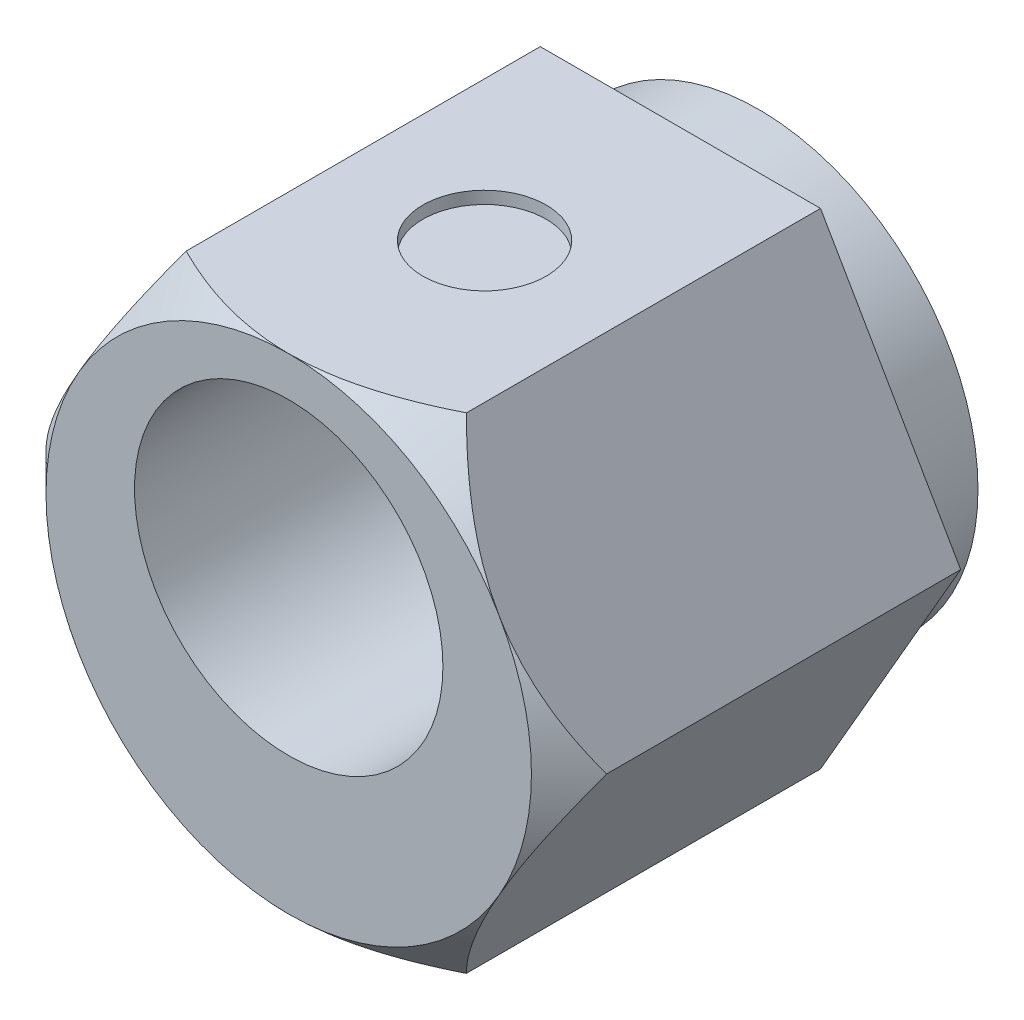
ISO-10303-21;
HEADER;
FILE_DESCRIPTION(('STEP AP214'),'2;1');
FILE_NAME('part.step','',(''),(''),'','','');
FILE_SCHEMA(('AUTOMOTIVE_DESIGN { 1 0 10303 214 1 1 1 1 }'));
ENDSEC;
DATA;
#1=APPLICATION_CONTEXT('core data for automotive mechanical design processes');
#2=APPLICATION_PROTOCOL_DEFINITION('international standard','automotive_design',2000,#1);
#3=PRODUCT_CONTEXT('',#1,'mechanical');
#4=PRODUCT('Part','Part','',(#3));
#5=PRODUCT_RELATED_PRODUCT_CATEGORY('part','',(#4));
#6=PRODUCT_DEFINITION_FORMATION('','',#4);
#7=PRODUCT_DEFINITION_CONTEXT('part definition',#1,'design');
#8=PRODUCT_DEFINITION('design','',#6,#7);
#9=PRODUCT_DEFINITION_SHAPE('','',#8);
#10=(LENGTH_UNIT() NAMED_UNIT(*) SI_UNIT(.MILLI.,.METRE.));
#11=(NAMED_UNIT(*) PLANE_ANGLE_UNIT() SI_UNIT($,.RADIAN.));
#12=(NAMED_UNIT(*) SI_UNIT($,.STERADIAN.) SOLID_ANGLE_UNIT());
#13=UNCERTAINTY_MEASURE_WITH_UNIT(LENGTH_MEASURE(1.E-05),#10,'distance_accuracy_value','');
#14=(GEOMETRIC_REPRESENTATION_CONTEXT(3) GLOBAL_UNCERTAINTY_ASSIGNED_CONTEXT((#13)) GLOBAL_UNIT_ASSIGNED_CONTEXT((#10,
#11,#12)) REPRESENTATION_CONTEXT('',''));
#15=CARTESIAN_POINT('',(0.,0.,0.));
#16=DIRECTION('',(0.,0.,1.));
#17=DIRECTION('',(1.,0.,0.));
#18=AXIS2_PLACEMENT_3D('',#15,#16,#17);
#19=CARTESIAN_POINT('',(2.27187330926118,-3.935,6.35));
#20=DIRECTION('',(-0.866025403784439,0.5,0.));
#21=DIRECTION('',(-0.5,-0.866025403784439,0.));
#22=AXIS2_PLACEMENT_3D('',#19,#20,#21);
#23=PLANE('',#22);
#24=CARTESIAN_POINT('',(2.27175783920734,-3.9352,5.74113790702225));
#25=CARTESIAN_POINT('',(2.31082331662368,-3.86753660829296,5.78019939782444));
#26=CARTESIAN_POINT('',(2.35018773661435,-3.79935543285864,5.81806250313159));
#27=CARTESIAN_POINT('',(2.42957604163856,-3.66185085502993,5.8910266504742));
#28=CARTESIAN_POINT('',(2.46960027263841,-3.59252685340433,5.92612618389363));
#29=CARTESIAN_POINT('',(2.59112694872726,-3.38203647594347,6.02703083232341));
#30=CARTESIAN_POINT('',(2.67366225000178,-3.23908114071799,6.08801147413054));
#31=CARTESIAN_POINT('',(2.84006902700017,-2.950856148233,6.19244398855424));
#32=CARTESIAN_POINT('',(2.9238984692984,-2.8056592950023,6.23615884690859));
#33=CARTESIAN_POINT('',(3.09340844196596,-2.51205940995248,6.30351651032578));
#34=CARTESIAN_POINT('',(3.17908378087713,-2.36366537000264,6.32720957015581));
#35=CARTESIAN_POINT('',(3.3267417531764,-2.10791425983772,6.34858629027159));
#36=CARTESIAN_POINT('',(3.38853414373876,-2.00088669986256,6.35175001817081));
#37=CARTESIAN_POINT('',(3.51201863282563,-1.78700529081743,6.3464170080399));
#38=CARTESIAN_POINT('',(3.57371068860348,-1.68015151578681,6.33791618237832));
#39=CARTESIAN_POINT('',(3.6965102561679,-1.46745642561775,6.30973894507781));
#40=CARTESIAN_POINT('',(3.75761703631313,-1.36161637771927,6.29005003415299));
#41=CARTESIAN_POINT('',(3.87878112158132,-1.15175402598215,6.24057140696216));
#42=CARTESIAN_POINT('',(3.93883850679851,-1.04773158341625,6.21078246514532));
#43=CARTESIAN_POINT('',(4.04545500054664,-0.86306639931963,6.14949467580114));
#44=CARTESIAN_POINT('',(4.09225015435056,-0.782014815383253,6.11960721855959));
#45=CARTESIAN_POINT('',(4.1850004009052,-0.621366675936064,6.05501569852719));
#46=CARTESIAN_POINT('',(4.23095546804853,-0.541770164778593,6.02031148918887));
#47=CARTESIAN_POINT('',(4.32188075595423,-0.384282946433077,5.94686444951026));
#48=CARTESIAN_POINT('',(4.36685356279846,-0.306387760019898,5.90813431896725));
#49=CARTESIAN_POINT('',(4.45596632914802,-0.152039921099436,5.82714402443281));
#50=CARTESIAN_POINT('',(4.50010677953052,-0.0755864183679793,5.78488602621755));
#51=CARTESIAN_POINT('',(4.54386208857619,0.000200000000002672,5.74113790702225));
#52=B_SPLINE_CURVE_WITH_KNOTS('',3,(#24,#25,#26,#27,#28,#29,#30,#31,#32,#33,#34,#35,#36,#37,#38,
#39,#40,#41,#42,#43,#44,#45,#46,#47,#48,#49,#50,#51),.UNSPECIFIED.,.F.,.F.,(4,2,2,2,2,2,2,2,2,2,
2,2,2,4),(0.,0.262034024169244,0.524210113306116,1.05139312717679,1.57020425028876,
2.08770925517824,2.45806190309844,2.82854436754425,3.19944154962779,3.57031029852357,
3.86491210567521,4.15952287791768,4.45323098658818,4.74676009388411),.UNSPECIFIED.);
#53=CARTESIAN_POINT('',(2.27187330926118,-3.935,5.74125338147763));
#54=VERTEX_POINT('',#53);
#55=CARTESIAN_POINT('',(3.40780996389177,-1.9675,6.35));
#56=VERTEX_POINT('',#55);
#57=EDGE_CURVE('E248',#54,#56,#52,.T.);
#58=ORIENTED_EDGE('',*,*,#57,.F.);
#59=DIRECTION('',(0.,0.,-1.));
#60=VECTOR('',#59,1.);
#61=CARTESIAN_POINT('',(2.27187330926118,-3.935,6.35));
#62=LINE('',#61,#60);
#63=CARTESIAN_POINT('',(2.27187330926118,-3.935,0.));
#64=VERTEX_POINT('',#63);
#65=EDGE_CURVE('E222',#54,#64,#62,.T.);
#66=ORIENTED_EDGE('',*,*,#65,.T.);
#67=DIRECTION('',(0.5,0.866025403784439,0.));
#68=VECTOR('',#67,1.);
#69=CARTESIAN_POINT('',(2.27187330926118,-3.935,0.));
#70=LINE('',#69,#68);
#71=CARTESIAN_POINT('',(4.54374661852235,0.,0.));
#72=VERTEX_POINT('',#71);
#73=EDGE_CURVE('E238',#64,#72,#70,.T.);
#74=ORIENTED_EDGE('',*,*,#73,.T.);
#75=DIRECTION('',(0.,0.,-1.));
#76=VECTOR('',#75,1.);
#77=CARTESIAN_POINT('',(4.54374661852235,0.,6.35));
#78=LINE('',#77,#76);
#79=CARTESIAN_POINT('',(4.54374661852235,0.,5.74125338147763));
#80=VERTEX_POINT('',#79);
#81=EDGE_CURVE('E212',#80,#72,#78,.T.);
#82=ORIENTED_EDGE('',*,*,#81,.F.);
#83=EDGE_CURVE('E174',#56,#80,#52,.T.);
#84=ORIENTED_EDGE('',*,*,#83,.F.);
#85=EDGE_LOOP('',(#58,#66,#74,#82,#84));
#86=FACE_BOUND('',#85,.T.);
#87=ADVANCED_FACE('F32',(#86),#23,.F.);
#88=CARTESIAN_POINT('',(4.54374661852235,0.,6.35));
#89=DIRECTION('',(-0.866025403784439,-0.5,0.));
#90=DIRECTION('',(0.5,-0.866025403784439,0.));
#91=AXIS2_PLACEMENT_3D('',#88,#89,#90);
#92=PLANE('',#91);
#93=CARTESIAN_POINT('',(4.54386208857619,-0.00019999999999746,5.74113790702226));
#94=CARTESIAN_POINT('',(4.50479661115985,0.0674633917070432,5.78019939782444));
#95=CARTESIAN_POINT('',(4.46543219116918,0.135644567141366,5.81806250313159));
#96=CARTESIAN_POINT('',(4.38604388614497,0.273149144970073,5.8910266504742));
#97=CARTESIAN_POINT('',(4.34601965514512,0.342473146595676,5.92612618389363));
#98=CARTESIAN_POINT('',(4.22449297905627,0.552963524056532,6.02703083232341));
#99=CARTESIAN_POINT('',(4.14195767778175,0.695918859282011,6.08801147413054));
#100=CARTESIAN_POINT('',(3.97555090078336,0.984143851766998,6.19244398855424));
#101=CARTESIAN_POINT('',(3.89172145848513,1.1293407049977,6.23615884690859));
#102=CARTESIAN_POINT('',(3.72221148581758,1.42294059004751,6.30351651032578));
#103=CARTESIAN_POINT('',(3.6365361469064,1.57133462999736,6.32720957015581));
#104=CARTESIAN_POINT('',(3.48887817460714,1.82708574016228,6.34858629027159));
#105=CARTESIAN_POINT('',(3.42708578404477,1.93411330013744,6.35175001817081));
#106=CARTESIAN_POINT('',(3.30360129495791,2.14799470918257,6.3464170080399));
#107=CARTESIAN_POINT('',(3.24190923918005,2.25484848421319,6.33791618237832));
#108=CARTESIAN_POINT('',(3.11910967161564,2.46754357438224,6.30973894507781));
#109=CARTESIAN_POINT('',(3.0580028914704,2.57338362228073,6.29005003415299));
#110=CARTESIAN_POINT('',(2.93683880620221,2.78324597401784,6.24057140696216));
#111=CARTESIAN_POINT('',(2.87678142098502,2.88726841658375,6.21078246514531));
#112=CARTESIAN_POINT('',(2.77016492723689,3.07193360068037,6.14949467580113));
#113=CARTESIAN_POINT('',(2.72336977343298,3.15298518461674,6.11960721855959));
#114=CARTESIAN_POINT('',(2.63061952687833,3.31363332406393,6.05501569852719));
#115=CARTESIAN_POINT('',(2.58466445973501,3.3932298352214,6.02031148918887));
#116=CARTESIAN_POINT('',(2.4937391718293,3.55071705356692,5.94686444951026));
#117=CARTESIAN_POINT('',(2.44876636498507,3.6286122399801,5.90813431896725));
#118=CARTESIAN_POINT('',(2.35965359863551,3.78296007890056,5.82714402443281));
#119=CARTESIAN_POINT('',(2.31551314825301,3.85941358163202,5.78488602621755));
#120=CARTESIAN_POINT('',(2.27175783920734,3.9352,5.74113790702225));
#121=B_SPLINE_CURVE_WITH_KNOTS('',3,(#93,#94,#95,#96,#97,#98,#99,#100,#101,#102,#103,#104,#105,
#106,#107,#108,#109,#110,#111,#112,#113,#114,#115,#116,#117,#118,#119,#120),.UNSPECIFIED.,.F.,
.F.,(4,2,2,2,2,2,2,2,2,2,2,2,2,4),(0.,0.262034024169244,0.524210113306116,1.05139312717678,
1.57020425028876,2.08770925517823,2.45806190309843,2.82854436754424,3.19944154962778,
3.57031029852356,3.8649121056752,4.15952287791767,4.45323098658817,4.7467600938841),.UNSPECIFIED.);
#122=CARTESIAN_POINT('',(3.40780996389177,1.9675,6.35));
#123=VERTEX_POINT('',#122);
#124=EDGE_CURVE('E172',#80,#123,#121,.T.);
#125=ORIENTED_EDGE('',*,*,#124,.F.);
#126=ORIENTED_EDGE('',*,*,#81,.T.);
#127=DIRECTION('',(-0.5,0.866025403784439,0.));
#128=VECTOR('',#127,1.);
#129=CARTESIAN_POINT('',(4.54374661852235,0.,0.));
#130=LINE('',#129,#128);
#131=CARTESIAN_POINT('',(2.27187330926118,3.935,0.));
#132=VERTEX_POINT('',#131);
#133=EDGE_CURVE('E235',#72,#132,#130,.T.);
#134=ORIENTED_EDGE('',*,*,#133,.T.);
#135=DIRECTION('',(0.,0.,-1.));
#136=VECTOR('',#135,1.);
#137=CARTESIAN_POINT('',(2.27187330926118,3.935,6.35));
#138=LINE('',#137,#136);
#139=CARTESIAN_POINT('',(2.27187330926118,3.935,5.74125338147763));
#140=VERTEX_POINT('',#139);
#141=EDGE_CURVE('E215',#140,#132,#138,.T.);
#142=ORIENTED_EDGE('',*,*,#141,.F.);
#143=EDGE_CURVE('E167',#123,#140,#121,.T.);
#144=ORIENTED_EDGE('',*,*,#143,.F.);
#145=EDGE_LOOP('',(#125,#126,#134,#142,#144));
#146=FACE_BOUND('',#145,.T.);
#147=ADVANCED_FACE('F180',(#146),#92,.F.);
#148=CARTESIAN_POINT('',(2.27187330926118,3.935,6.35));
#149=DIRECTION('',(0.,-1.,0.));
#150=DIRECTION('',(0.,0.,-1.));
#151=AXIS2_PLACEMENT_3D('',#148,#149,#150);
#152=PLANE('',#151);
#153=CARTESIAN_POINT('',(0.,3.935,3.175));
#154=DIRECTION('',(0.,1.,0.));
#155=DIRECTION('',(0.,0.,1.));
#156=AXIS2_PLACEMENT_3D('',#153,#154,#155);
#157=CIRCLE('',#156,1.);
#158=CARTESIAN_POINT('',(0.,3.935,4.175));
#159=VERTEX_POINT('',#158);
#160=EDGE_CURVE('E246',#159,#159,#157,.T.);
#161=ORIENTED_EDGE('',*,*,#160,.F.);
#162=EDGE_LOOP('',(#161));
#163=FACE_BOUND('',#162,.T.);
#164=CARTESIAN_POINT('',(-13.1236901526752,3.935,-3.41592946567602));
#165=CARTESIAN_POINT('',(-12.8031195440559,3.935,-3.10889289114892));
#166=CARTESIAN_POINT('',(-12.4821108648223,3.935,-2.8023113742663));
#167=CARTESIAN_POINT('',(-11.8389221735785,3.935,-2.19034787753257));
#168=CARTESIAN_POINT('',(-11.5167421042617,3.935,-1.88496595793061));
#169=CARTESIAN_POINT('',(-10.8700823429703,3.935,-1.27490570063593));
#170=CARTESIAN_POINT('',(-10.5455988029611,3.935,-0.970231438129506));
#171=CARTESIAN_POINT('',(-9.89478736268741,3.935,-0.362879907042088));
#172=CARTESIAN_POINT('',(-9.56845952755677,3.935,-0.0602025687450328));
#173=CARTESIAN_POINT('',(-8.87472102038576,3.935,0.578081233468633));
#174=CARTESIAN_POINT('',(-8.50700688270092,3.935,0.913358297375564));
#175=CARTESIAN_POINT('',(-7.76731901306219,3.935,1.57929169459804));
#176=CARTESIAN_POINT('',(-7.39534478298294,3.935,1.90994747730821));
#177=CARTESIAN_POINT('',(-6.83307463315123,3.935,2.40040387622325));
#178=CARTESIAN_POINT('',(-6.64508172586861,3.935,2.56284332383779));
#179=CARTESIAN_POINT('',(-6.26720974784876,3.935,2.88551089592677));
#180=CARTESIAN_POINT('',(-6.0773307119418,3.935,3.04573906110586));
#181=CARTESIAN_POINT('',(-5.69527444823266,3.935,3.36335940486739));
#182=CARTESIAN_POINT('',(-5.50309768174997,3.935,3.52075213733078));
#183=CARTESIAN_POINT('',(-5.11582420868297,3.935,3.83189555157435));
#184=CARTESIAN_POINT('',(-4.9207276819186,3.935,3.98564645615061));
#185=CARTESIAN_POINT('',(-4.59066963103563,3.935,4.23923777501762));
#186=CARTESIAN_POINT('',(-4.45672034623056,3.935,4.34039432268771));
#187=CARTESIAN_POINT('',(-4.18679523009464,3.935,4.53998371954863));
#188=CARTESIAN_POINT('',(-4.05081933693232,3.935,4.63841648537453));
#189=CARTESIAN_POINT('',(-3.77620153052435,3.935,4.83207201127131));
#190=CARTESIAN_POINT('',(-3.63755500466042,3.935,4.92728825343199));
#191=CARTESIAN_POINT('',(-3.35739305428911,3.935,5.11340985393257));
#192=CARTESIAN_POINT('',(-3.21587776632741,3.935,5.20431541676518));
#193=CARTESIAN_POINT('',(-2.93248486646283,3.935,5.37873022055762));
#194=CARTESIAN_POINT('',(-2.79067930340835,3.935,5.46235583033874));
#195=CARTESIAN_POINT('',(-2.50319310985428,3.935,5.62281496077693));
#196=CARTESIAN_POINT('',(-2.35751148463348,3.935,5.69964671561026));
#197=CARTESIAN_POINT('',(-2.06226709210795,3.935,5.84420557337593));
#198=CARTESIAN_POINT('',(-1.91271910896614,3.935,5.9119625750583));
#199=CARTESIAN_POINT('',(-1.60896116978889,3.935,6.03602304691689));
#200=CARTESIAN_POINT('',(-1.45475443067069,3.935,6.09233422190501));
#201=CARTESIAN_POINT('',(-1.20045367872989,3.935,6.17200976074409));
#202=CARTESIAN_POINT('',(-1.10174756702824,3.935,6.19981119655868));
#203=CARTESIAN_POINT('',(-0.902705453338799,3.935,6.24893693510281));
#204=CARTESIAN_POINT('',(-0.802369277526225,3.935,6.27026054221768));
#205=CARTESIAN_POINT('',(-0.600677306359168,3.935,6.30565166626418));
#206=CARTESIAN_POINT('',(-0.499324791055474,3.935,6.31973767616047));
#207=CARTESIAN_POINT('',(-0.295844893857511,3.935,6.34019311884467));
#208=CARTESIAN_POINT('',(-0.19371755506928,3.935,6.34656297778597));
#209=CARTESIAN_POINT('',(0.0317597016033228,3.935,6.35179824290066));
#210=CARTESIAN_POINT('',(0.155156367773224,3.935,6.34885168911598));
#211=CARTESIAN_POINT('',(0.401139414943979,3.935,6.33151175443196));
#212=CARTESIAN_POINT('',(0.523725672494003,3.935,6.31711666830712));
#213=CARTESIAN_POINT('',(0.76765747972916,3.935,6.27763599318921));
#214=CARTESIAN_POINT('',(0.888995881860383,3.935,6.25250681522559));
#215=CARTESIAN_POINT('',(1.12929608238302,3.935,6.19281457883945));
#216=CARTESIAN_POINT('',(1.24825763094315,3.935,6.15825053425755));
#217=CARTESIAN_POINT('',(1.60548760242359,3.935,6.04112194575606));
#218=CARTESIAN_POINT('',(1.83964307730525,3.935,5.94593263396749));
#219=CARTESIAN_POINT('',(2.18280484497915,3.935,5.78626578439461));
#220=CARTESIAN_POINT('',(2.29595874697007,3.935,5.73016346030901));
#221=CARTESIAN_POINT('',(2.51984341612594,3.935,5.61330683052985));
#222=CARTESIAN_POINT('',(2.63057453648393,3.935,5.55255320879083));
#223=CARTESIAN_POINT('',(2.8514014363745,3.935,5.42635931686595));
#224=CARTESIAN_POINT('',(2.96146589768556,3.935,5.36086477127302));
#225=CARTESIAN_POINT('',(3.17961590777305,3.935,5.22666129988295));
#226=CARTESIAN_POINT('',(3.28770141327481,3.935,5.15795230391057));
#227=CARTESIAN_POINT('',(3.50203858606768,3.935,5.01794026649113));
#228=CARTESIAN_POINT('',(3.60829177117163,3.935,4.94663954076899));
#229=CARTESIAN_POINT('',(3.81927009139693,3.935,4.80182751727686));
#230=CARTESIAN_POINT('',(3.92399528884536,3.935,4.7283163100496));
#231=CARTESIAN_POINT('',(4.26762948621968,3.935,4.48252454868428));
#232=CARTESIAN_POINT('',(4.50369936164225,3.935,4.30627340705269));
#233=CARTESIAN_POINT('',(4.97067864192371,3.935,3.94704122053123));
#234=CARTESIAN_POINT('',(5.20158705610022,3.935,3.764058901202));
#235=CARTESIAN_POINT('',(5.65961269187026,3.935,3.39316510070156));
#236=CARTESIAN_POINT('',(5.88672773089495,3.935,3.20525093164967));
#237=CARTESIAN_POINT('',(6.33795252588463,3.935,2.82584582987841));
#238=CARTESIAN_POINT('',(6.56206218345843,3.935,2.63435478054663));
#239=CARTESIAN_POINT('',(7.00849695323274,3.935,2.24816692555583));
#240=CARTESIAN_POINT('',(7.23081606517612,3.935,2.05346319618324));
#241=CARTESIAN_POINT('',(7.67357642035214,3.935,1.66192866942992));
#242=CARTESIAN_POINT('',(7.89401763332101,3.935,1.46509783788486));
#243=CARTESIAN_POINT('',(8.55293598005197,3.935,0.872246101755066));
#244=CARTESIAN_POINT('',(8.9891655383951,3.935,0.473728323137581));
#245=CARTESIAN_POINT('',(9.80466067684911,3.935,-0.278818950927105));
#246=CARTESIAN_POINT('',(10.1843882160902,3.935,-0.63235001731397));
#247=CARTESIAN_POINT('',(10.941579142227,3.935,-1.34190416880677));
#248=CARTESIAN_POINT('',(11.3190422963122,3.935,-1.69792750226642));
#249=CARTESIAN_POINT('',(12.0704413810763,3.935,-2.41009605435369));
#250=CARTESIAN_POINT('',(12.4443855483041,3.935,-2.76623259460942));
#251=CARTESIAN_POINT('',(13.1908789142557,3.935,-3.47987607095009));
#252=CARTESIAN_POINT('',(13.5634282742904,3.935,-3.83738283824041));
#253=CARTESIAN_POINT('',(13.935484735638,3.935,-4.19539915945703));
#254=B_SPLINE_CURVE_WITH_KNOTS('',3,(#164,#165,#166,#167,#168,#169,#170,#171,#172,#173,#174,
#175,#176,#177,#178,#179,#180,#181,#182,#183,#184,#185,#186,#187,#188,#189,#190,#191,#192,#193,
#194,#195,#196,#197,#198,#199,#200,#201,#202,#203,#204,#205,#206,#207,#208,#209,#210,#211,#212,
#213,#214,#215,#216,#217,#218,#219,#220,#221,#222,#223,#224,#225,#226,#227,#228,#229,#230,#231,
#232,#233,#234,#235,#236,#237,#238,#239,#240,#241,#242,#243,#244,#245,#246,#247,#248,#249,#250,
#251,#252,#253),.UNSPECIFIED.,.F.,.F.,(4,2,2,2,2,2,2,2,2,2,2,2,2,2,2,2,2,2,2,2,2,2,2,2,2,2,2,2,
2,2,2,2,2,2,2,2,2,2,2,2,2,2,2,2,4),(0.,1.33166737410768,2.66340079661562,3.99870110863636,
5.33395455368537,6.8267872394219,8.31979629882266,9.06513664918736,9.81046326119244,
10.5556426648754,11.3007763623614,11.8043123221086,12.3078636762281,12.8123807031937,
13.3168737725696,13.8106110967637,14.3044763757059,14.7966722298962,15.2885356547855,
15.5959914578669,15.9034802650982,16.2101794433857,16.5168616822885,16.886591181482,
17.256375761122,17.6276764536979,17.9990159705603,18.755162227821,19.1340132033387,
19.5128085769528,19.8969796934452,20.2811592007632,20.66500349517,21.0488320884306,
21.9324494577438,22.8162349955618,23.7005126350207,24.5848191539302,25.4713783562851,
26.3579518192813,28.1304708443723,29.6869288193223,31.2435441676875,32.792736046513,
34.3417428537419),.UNSPECIFIED.);
#255=CARTESIAN_POINT('',(0.,3.935,6.35));
#256=VERTEX_POINT('',#255);
#257=EDGE_CURVE('E173',#140,#256,#254,.F.);
#258=ORIENTED_EDGE('',*,*,#257,.F.);
#259=ORIENTED_EDGE('',*,*,#141,.T.);
#260=DIRECTION('',(-1.,0.,0.));
#261=VECTOR('',#260,1.);
#262=CARTESIAN_POINT('',(2.27187330926118,3.935,0.));
#263=LINE('',#262,#261);
#264=CARTESIAN_POINT('',(-2.27187330926118,3.935,0.));
#265=VERTEX_POINT('',#264);
#266=EDGE_CURVE('E232',#132,#265,#263,.T.);
#267=ORIENTED_EDGE('',*,*,#266,.T.);
#268=DIRECTION('',(0.,0.,-1.));
#269=VECTOR('',#268,1.);
#270=CARTESIAN_POINT('',(-2.27187330926118,3.935,6.35));
#271=LINE('',#270,#269);
#272=CARTESIAN_POINT('',(-2.27187330926118,3.935,5.74125338147763));
#273=VERTEX_POINT('',#272);
#274=EDGE_CURVE('E217',#273,#265,#271,.T.);
#275=ORIENTED_EDGE('',*,*,#274,.F.);
#276=EDGE_CURVE('E110',#256,#273,#254,.F.);
#277=ORIENTED_EDGE('',*,*,#276,.F.);
#278=EDGE_LOOP('',(#258,#259,#267,#275,#277));
#279=FACE_BOUND('',#278,.T.);
#280=ADVANCED_FACE('F183',(#163,#279),#152,.F.);
#281=CARTESIAN_POINT('',(-2.27187330926118,3.935,6.35));
#282=DIRECTION('',(0.866025403784439,-0.5,0.));
#283=DIRECTION('',(0.5,0.866025403784439,0.));
#284=AXIS2_PLACEMENT_3D('',#281,#282,#283);
#285=PLANE('',#284);
#286=CARTESIAN_POINT('',(-2.27175783920734,3.9352,5.74113790702225));
#287=CARTESIAN_POINT('',(-2.31082331662368,3.86753660829296,5.78019939782443));
#288=CARTESIAN_POINT('',(-2.35018773661435,3.79935543285864,5.81806250313158));
#289=CARTESIAN_POINT('',(-2.42957604163856,3.66185085502993,5.8910266504742));
#290=CARTESIAN_POINT('',(-2.46960027263841,3.59252685340433,5.92612618389363));
#291=CARTESIAN_POINT('',(-2.59112694872726,3.38203647594347,6.02703083232341));
#292=CARTESIAN_POINT('',(-2.67366225000178,3.23908114071799,6.08801147413053));
#293=CARTESIAN_POINT('',(-2.84006902700017,2.950856148233,6.19244398855424));
#294=CARTESIAN_POINT('',(-2.9238984692984,2.8056592950023,6.23615884690859));
#295=CARTESIAN_POINT('',(-3.09340844196596,2.51205940995248,6.30351651032578));
#296=CARTESIAN_POINT('',(-3.17908378087713,2.36366537000264,6.32720957015581));
#297=CARTESIAN_POINT('',(-3.3267417531764,2.10791425983772,6.34858629027159));
#298=CARTESIAN_POINT('',(-3.38853414373876,2.00088669986256,6.35175001817081));
#299=CARTESIAN_POINT('',(-3.51201863282563,1.78700529081743,6.3464170080399));
#300=CARTESIAN_POINT('',(-3.57371068860349,1.68015151578681,6.33791618237832));
#301=CARTESIAN_POINT('',(-3.6965102561679,1.46745642561775,6.30973894507781));
#302=CARTESIAN_POINT('',(-3.75761703631313,1.36161637771927,6.29005003415299));
#303=CARTESIAN_POINT('',(-3.87878112158132,1.15175402598215,6.24057140696216));
#304=CARTESIAN_POINT('',(-3.93883850679851,1.04773158341625,6.21078246514531));
#305=CARTESIAN_POINT('',(-4.04545500054664,0.86306639931963,6.14949467580113));
#306=CARTESIAN_POINT('',(-4.09225015435056,0.782014815383252,6.11960721855959));
#307=CARTESIAN_POINT('',(-4.18500040090521,0.621366675936063,6.05501569852719));
#308=CARTESIAN_POINT('',(-4.23095546804853,0.541770164778593,6.02031148918887));
#309=CARTESIAN_POINT('',(-4.32188075595424,0.384282946433078,5.94686444951026));
#310=CARTESIAN_POINT('',(-4.36685356279846,0.306387760019899,5.90813431896725));
#311=CARTESIAN_POINT('',(-4.45596632914803,0.152039921099437,5.82714402443281));
#312=CARTESIAN_POINT('',(-4.50010677953052,0.07558641836798,5.78488602621755));
#313=CARTESIAN_POINT('',(-4.54386208857619,-0.000200000000002143,5.74113790702225));
#314=B_SPLINE_CURVE_WITH_KNOTS('',3,(#286,#287,#288,#289,#290,#291,#292,#293,#294,#295,#296,
#297,#298,#299,#300,#301,#302,#303,#304,#305,#306,#307,#308,#309,#310,#311,#312,#313),
.UNSPECIFIED.,.F.,.F.,(4,2,2,2,2,2,2,2,2,2,2,2,2,4),(0.,0.262034024169245,0.524210113306118,
1.05139312717679,1.57020425028876,2.08770925517824,2.45806190309844,2.82854436754425,
3.19944154962779,3.57031029852357,3.86491210567521,4.15952287791768,4.45323098658818,
4.74676009388411),.UNSPECIFIED.);
#315=CARTESIAN_POINT('',(-3.40780996389176,1.9675,6.35));
#316=VERTEX_POINT('',#315);
#317=EDGE_CURVE('E104',#273,#316,#314,.T.);
#318=ORIENTED_EDGE('',*,*,#317,.F.);
#319=ORIENTED_EDGE('',*,*,#274,.T.);
#320=DIRECTION('',(-0.5,-0.866025403784439,0.));
#321=VECTOR('',#320,1.);
#322=CARTESIAN_POINT('',(-2.27187330926118,3.935,0.));
#323=LINE('',#322,#321);
#324=CARTESIAN_POINT('',(-4.54374661852236,0.,0.));
#325=VERTEX_POINT('',#324);
#326=EDGE_CURVE('E230',#265,#325,#323,.T.);
#327=ORIENTED_EDGE('',*,*,#326,.T.);
#328=DIRECTION('',(0.,0.,-1.));
#329=VECTOR('',#328,1.);
#330=CARTESIAN_POINT('',(-4.54374661852236,0.,6.35));
#331=LINE('',#330,#329);
#332=CARTESIAN_POINT('',(-4.54374661852236,0.,5.74125338147763));
#333=VERTEX_POINT('',#332);
#334=EDGE_CURVE('E128',#333,#325,#331,.T.);
#335=ORIENTED_EDGE('',*,*,#334,.F.);
#336=EDGE_CURVE('E114',#316,#333,#314,.T.);
#337=ORIENTED_EDGE('',*,*,#336,.F.);
#338=EDGE_LOOP('',(#318,#319,#327,#335,#337));
#339=FACE_BOUND('',#338,.T.);
#340=ADVANCED_FACE('F126',(#339),#285,.F.);
#341=CARTESIAN_POINT('',(-4.54374661852236,0.,6.35));
#342=DIRECTION('',(0.866025403784439,0.5,0.));
#343=DIRECTION('',(-0.5,0.866025403784439,0.));
#344=AXIS2_PLACEMENT_3D('',#341,#342,#343);
#345=PLANE('',#344);
#346=CARTESIAN_POINT('',(-4.54386208857619,0.000199999999998345,5.74113790702225));
#347=CARTESIAN_POINT('',(-4.50479661115985,-0.0674633917070421,5.78019939782444));
#348=CARTESIAN_POINT('',(-4.46543219116918,-0.135644567141364,5.81806250313159));
#349=CARTESIAN_POINT('',(-4.38604388614497,-0.273149144970072,5.8910266504742));
#350=CARTESIAN_POINT('',(-4.34601965514513,-0.342473146595675,5.92612618389363));
#351=CARTESIAN_POINT('',(-4.22449297905627,-0.552963524056533,6.02703083232341));
#352=CARTESIAN_POINT('',(-4.14195767778175,-0.695918859282012,6.08801147413053));
#353=CARTESIAN_POINT('',(-3.97555090078336,-0.984143851766999,6.19244398855424));
#354=CARTESIAN_POINT('',(-3.89172145848513,-1.1293407049977,6.23615884690859));
#355=CARTESIAN_POINT('',(-3.72221148581758,-1.42294059004752,6.30351651032578));
#356=CARTESIAN_POINT('',(-3.6365361469064,-1.57133462999736,6.32720957015581));
#357=CARTESIAN_POINT('',(-3.48887817460714,-1.82708574016228,6.34858629027159));
#358=CARTESIAN_POINT('',(-3.42708578404477,-1.93411330013744,6.35175001817081));
#359=CARTESIAN_POINT('',(-3.30360129495791,-2.14799470918257,6.3464170080399));
#360=CARTESIAN_POINT('',(-3.24190923918005,-2.25484848421319,6.33791618237832));
#361=CARTESIAN_POINT('',(-3.11910967161564,-2.46754357438224,6.3097389450778));
#362=CARTESIAN_POINT('',(-3.0580028914704,-2.57338362228073,6.29005003415298));
#363=CARTESIAN_POINT('',(-2.93683880620221,-2.78324597401785,6.24057140696216));
#364=CARTESIAN_POINT('',(-2.87678142098502,-2.88726841658375,6.21078246514531));
#365=CARTESIAN_POINT('',(-2.77016492723689,-3.07193360068037,6.14949467580113));
#366=CARTESIAN_POINT('',(-2.72336977343298,-3.15298518461675,6.11960721855958));
#367=CARTESIAN_POINT('',(-2.63061952687833,-3.31363332406393,6.05501569852719));
#368=CARTESIAN_POINT('',(-2.58466445973501,-3.39322983522141,6.02031148918886));
#369=CARTESIAN_POINT('',(-2.4937391718293,-3.55071705356692,5.94686444951026));
#370=CARTESIAN_POINT('',(-2.44876636498508,-3.6286122399801,5.90813431896725));
#371=CARTESIAN_POINT('',(-2.35965359863551,-3.78296007890056,5.8271440244328));
#372=CARTESIAN_POINT('',(-2.31551314825301,-3.85941358163202,5.78488602621755));
#373=CARTESIAN_POINT('',(-2.27175783920734,-3.9352,5.74113790702225));
#374=B_SPLINE_CURVE_WITH_KNOTS('',3,(#346,#347,#348,#349,#350,#351,#352,#353,#354,#355,#356,
#357,#358,#359,#360,#361,#362,#363,#364,#365,#366,#367,#368,#369,#370,#371,#372,#373),
.UNSPECIFIED.,.F.,.F.,(4,2,2,2,2,2,2,2,2,2,2,2,2,4),(0.,0.262034024169244,0.524210113306117,
1.05139312717678,1.57020425028876,2.08770925517823,2.45806190309843,2.82854436754425,
3.19944154962778,3.57031029852356,3.86491210567521,4.15952287791767,4.45323098658817,
4.7467600938841),.UNSPECIFIED.);
#375=CARTESIAN_POINT('',(-3.40780996389176,-1.9675,6.35));
#376=VERTEX_POINT('',#375);
#377=EDGE_CURVE('E119',#333,#376,#374,.T.);
#378=ORIENTED_EDGE('',*,*,#377,.F.);
#379=ORIENTED_EDGE('',*,*,#334,.T.);
#380=DIRECTION('',(0.5,-0.866025403784439,0.));
#381=VECTOR('',#380,1.);
#382=CARTESIAN_POINT('',(-4.54374661852236,0.,0.));
#383=LINE('',#382,#381);
#384=CARTESIAN_POINT('',(-2.27187330926118,-3.935,0.));
#385=VERTEX_POINT('',#384);
#386=EDGE_CURVE('E227',#325,#385,#383,.T.);
#387=ORIENTED_EDGE('',*,*,#386,.T.);
#388=DIRECTION('',(0.,0.,-1.));
#389=VECTOR('',#388,1.);
#390=CARTESIAN_POINT('',(-2.27187330926118,-3.935,6.35));
#391=LINE('',#390,#389);
#392=CARTESIAN_POINT('',(-2.27187330926118,-3.935,5.74125338147763));
#393=VERTEX_POINT('',#392);
#394=EDGE_CURVE('E220',#393,#385,#391,.T.);
#395=ORIENTED_EDGE('',*,*,#394,.F.);
#396=EDGE_CURVE('E129',#376,#393,#374,.T.);
#397=ORIENTED_EDGE('',*,*,#396,.F.);
#398=EDGE_LOOP('',(#378,#379,#387,#395,#397));
#399=FACE_BOUND('',#398,.T.);
#400=ADVANCED_FACE('F274',(#399),#345,.F.);
#401=CARTESIAN_POINT('',(-2.27187330926118,-3.935,6.35));
#402=DIRECTION('',(0.,1.,0.));
#403=DIRECTION('',(-1.,0.,0.));
#404=AXIS2_PLACEMENT_3D('',#401,#402,#403);
#405=PLANE('',#404);
#406=CARTESIAN_POINT('',(-13.1236901526753,-3.935,-3.41592946567604));
#407=CARTESIAN_POINT('',(-12.8031195440559,-3.935,-3.10889289114894));
#408=CARTESIAN_POINT('',(-12.4821108648224,-3.935,-2.80231137426632));
#409=CARTESIAN_POINT('',(-11.8389221735785,-3.935,-2.19034787753258));
#410=CARTESIAN_POINT('',(-11.5167421042617,-3.935,-1.88496595793062));
#411=CARTESIAN_POINT('',(-10.8700823429703,-3.935,-1.27490570063594));
#412=CARTESIAN_POINT('',(-10.5455988029612,-3.935,-0.970231438129515));
#413=CARTESIAN_POINT('',(-9.89478736268742,-3.935,-0.362879907042095));
#414=CARTESIAN_POINT('',(-9.56845952755678,-3.935,-0.0602025687450395));
#415=CARTESIAN_POINT('',(-8.87472102038577,-3.935,0.578081233468628));
#416=CARTESIAN_POINT('',(-8.50700688270092,-3.935,0.913358297375561));
#417=CARTESIAN_POINT('',(-7.76731901306219,-3.935,1.57929169459804));
#418=CARTESIAN_POINT('',(-7.39534478298295,-3.935,1.90994747730821));
#419=CARTESIAN_POINT('',(-6.83307463315124,-3.935,2.40040387622325));
#420=CARTESIAN_POINT('',(-6.64508172586861,-3.935,2.56284332383779));
#421=CARTESIAN_POINT('',(-6.26720974784876,-3.935,2.88551089592678));
#422=CARTESIAN_POINT('',(-6.0773307119418,-3.935,3.04573906110586));
#423=CARTESIAN_POINT('',(-5.69527444823266,-3.935,3.36335940486739));
#424=CARTESIAN_POINT('',(-5.50309768174997,-3.935,3.52075213733078));
#425=CARTESIAN_POINT('',(-5.11582420868297,-3.935,3.83189555157435));
#426=CARTESIAN_POINT('',(-4.9207276819186,-3.935,3.98564645615061));
#427=CARTESIAN_POINT('',(-4.59066963103563,-3.935,4.23923777501762));
#428=CARTESIAN_POINT('',(-4.45672034623056,-3.935,4.34039432268772));
#429=CARTESIAN_POINT('',(-4.18679523009464,-3.935,4.53998371954864));
#430=CARTESIAN_POINT('',(-4.05081933693232,-3.935,4.63841648537453));
#431=CARTESIAN_POINT('',(-3.77620153052434,-3.935,4.83207201127131));
#432=CARTESIAN_POINT('',(-3.63755500466042,-3.935,4.927288253432));
#433=CARTESIAN_POINT('',(-3.35739305428911,-3.935,5.11340985393257));
#434=CARTESIAN_POINT('',(-3.21587776632741,-3.935,5.20431541676518));
#435=CARTESIAN_POINT('',(-2.93248486646282,-3.935,5.37873022055763));
#436=CARTESIAN_POINT('',(-2.79067930340835,-3.935,5.46235583033874));
#437=CARTESIAN_POINT('',(-2.50319310985428,-3.935,5.62281496077693));
#438=CARTESIAN_POINT('',(-2.35751148463348,-3.935,5.69964671561026));
#439=CARTESIAN_POINT('',(-2.06226709210795,-3.935,5.84420557337593));
#440=CARTESIAN_POINT('',(-1.91271910896614,-3.935,5.9119625750583));
#441=CARTESIAN_POINT('',(-1.60896116978889,-3.935,6.0360230469169));
#442=CARTESIAN_POINT('',(-1.45475443067069,-3.935,6.09233422190502));
#443=CARTESIAN_POINT('',(-1.2004536787299,-3.935,6.1720097607441));
#444=CARTESIAN_POINT('',(-1.10174756702824,-3.935,6.19981119655868));
#445=CARTESIAN_POINT('',(-0.902705453338802,-3.935,6.24893693510281));
#446=CARTESIAN_POINT('',(-0.802369277526228,-3.935,6.27026054221768));
#447=CARTESIAN_POINT('',(-0.600677306359172,-3.935,6.30565166626418));
#448=CARTESIAN_POINT('',(-0.499324791055479,-3.935,6.31973767616047));
#449=CARTESIAN_POINT('',(-0.295844893857515,-3.935,6.34019311884467));
#450=CARTESIAN_POINT('',(-0.193717555069284,-3.935,6.34656297778597));
#451=CARTESIAN_POINT('',(0.0317597016033217,-3.935,6.35179824290067));
#452=CARTESIAN_POINT('',(0.155156367773224,-3.935,6.34885168911598));
#453=CARTESIAN_POINT('',(0.40113941494398,-3.935,6.33151175443196));
#454=CARTESIAN_POINT('',(0.523725672494003,-3.935,6.31711666830712));
#455=CARTESIAN_POINT('',(0.76765747972916,-3.935,6.27763599318922));
#456=CARTESIAN_POINT('',(0.888995881860384,-3.935,6.2525068152256));
#457=CARTESIAN_POINT('',(1.12929608238302,-3.935,6.19281457883946));
#458=CARTESIAN_POINT('',(1.24825763094315,-3.935,6.15825053425755));
#459=CARTESIAN_POINT('',(1.60548760242358,-3.935,6.04112194575605));
#460=CARTESIAN_POINT('',(1.83964307730524,-3.935,5.94593263396749));
#461=CARTESIAN_POINT('',(2.18280484497915,-3.935,5.78626578439461));
#462=CARTESIAN_POINT('',(2.29595874697007,-3.935,5.73016346030902));
#463=CARTESIAN_POINT('',(2.51984341612594,-3.935,5.61330683052985));
#464=CARTESIAN_POINT('',(2.63057453648393,-3.935,5.55255320879083));
#465=CARTESIAN_POINT('',(2.8514014363745,-3.935,5.42635931686595));
#466=CARTESIAN_POINT('',(2.96146589768556,-3.935,5.36086477127302));
#467=CARTESIAN_POINT('',(3.17961590777305,-3.935,5.22666129988295));
#468=CARTESIAN_POINT('',(3.28770141327481,-3.935,5.15795230391057));
#469=CARTESIAN_POINT('',(3.50203858606768,-3.935,5.01794026649114));
#470=CARTESIAN_POINT('',(3.60829177117163,-3.935,4.94663954076899));
#471=CARTESIAN_POINT('',(3.81927009139693,-3.935,4.80182751727686));
#472=CARTESIAN_POINT('',(3.92399528884536,-3.935,4.7283163100496));
#473=CARTESIAN_POINT('',(4.26762948621967,-3.935,4.48252454868428));
#474=CARTESIAN_POINT('',(4.50369936164225,-3.935,4.30627340705269));
#475=CARTESIAN_POINT('',(4.97067864192371,-3.935,3.94704122053124));
#476=CARTESIAN_POINT('',(5.20158705610022,-3.935,3.764058901202));
#477=CARTESIAN_POINT('',(5.65961269187026,-3.935,3.39316510070156));
#478=CARTESIAN_POINT('',(5.88672773089495,-3.935,3.20525093164967));
#479=CARTESIAN_POINT('',(6.33795252588463,-3.935,2.82584582987841));
#480=CARTESIAN_POINT('',(6.56206218345843,-3.935,2.63435478054663));
#481=CARTESIAN_POINT('',(7.00849695323274,-3.935,2.24816692555583));
#482=CARTESIAN_POINT('',(7.23081606517612,-3.935,2.05346319618324));
#483=CARTESIAN_POINT('',(7.67357642035214,-3.935,1.66192866942992));
#484=CARTESIAN_POINT('',(7.894017633321,-3.935,1.46509783788487));
#485=CARTESIAN_POINT('',(8.55293598005197,-3.935,0.872246101755067));
#486=CARTESIAN_POINT('',(8.9891655383951,-3.935,0.473728323137581));
#487=CARTESIAN_POINT('',(9.80466067684911,-3.935,-0.278818950927107));
#488=CARTESIAN_POINT('',(10.1843882160902,-3.935,-0.632350017313972));
#489=CARTESIAN_POINT('',(10.941579142227,-3.935,-1.34190416880678));
#490=CARTESIAN_POINT('',(11.3190422963122,-3.935,-1.69792750226642));
#491=CARTESIAN_POINT('',(12.0704413810763,-3.935,-2.41009605435369));
#492=CARTESIAN_POINT('',(12.4443855483041,-3.935,-2.76623259460942));
#493=CARTESIAN_POINT('',(13.1908789142557,-3.935,-3.47987607095009));
#494=CARTESIAN_POINT('',(13.5634282742904,-3.935,-3.83738283824042));
#495=CARTESIAN_POINT('',(13.935484735638,-3.935,-4.19539915945703));
#496=B_SPLINE_CURVE_WITH_KNOTS('',3,(#406,#407,#408,#409,#410,#411,#412,#413,#414,#415,#416,
#417,#418,#419,#420,#421,#422,#423,#424,#425,#426,#427,#428,#429,#430,#431,#432,#433,#434,#435,
#436,#437,#438,#439,#440,#441,#442,#443,#444,#445,#446,#447,#448,#449,#450,#451,#452,#453,#454,
#455,#456,#457,#458,#459,#460,#461,#462,#463,#464,#465,#466,#467,#468,#469,#470,#471,#472,#473,
#474,#475,#476,#477,#478,#479,#480,#481,#482,#483,#484,#485,#486,#487,#488,#489,#490,#491,#492,
#493,#494,#495),.UNSPECIFIED.,.F.,.F.,(4,2,2,2,2,2,2,2,2,2,2,2,2,2,2,2,2,2,2,2,2,2,2,2,2,2,2,2,
2,2,2,2,2,2,2,2,2,2,2,2,2,2,2,2,4),(0.,1.33166737410768,2.66340079661564,3.99870110863637,
5.33395455368539,6.82678723942193,8.3197962988227,9.06513664918739,9.81046326119247,
10.5556426648755,11.3007763623614,11.8043123221086,12.3078636762282,12.8123807031937,
13.3168737725697,13.8106110967637,14.3044763757059,14.7966722298962,15.2885356547856,
15.595991457867,15.9034802650982,16.2101794433857,16.5168616822885,16.886591181482,
17.256375761122,17.6276764536979,17.9990159705604,18.755162227821,19.1340132033388,
19.5128085769529,19.8969796934452,20.2811592007633,20.6650034951701,21.0488320884306,
21.9324494577439,22.8162349955619,23.7005126350207,24.5848191539302,25.4713783562852,
26.3579518192813,28.1304708443723,29.6869288193224,31.2435441676876,32.7927360465131,
34.3417428537419),.UNSPECIFIED.);
#497=CARTESIAN_POINT('',(0.,-3.935,6.35));
#498=VERTEX_POINT('',#497);
#499=EDGE_CURVE('E278',#393,#498,#496,.T.);
#500=ORIENTED_EDGE('',*,*,#499,.F.);
#501=ORIENTED_EDGE('',*,*,#394,.T.);
#502=DIRECTION('',(1.,0.,0.));
#503=VECTOR('',#502,1.);
#504=CARTESIAN_POINT('',(-2.27187330926118,-3.935,0.));
#505=LINE('',#504,#503);
#506=EDGE_CURVE('E224',#385,#64,#505,.T.);
#507=ORIENTED_EDGE('',*,*,#506,.T.);
#508=ORIENTED_EDGE('',*,*,#65,.F.);
#509=EDGE_CURVE('E123',#498,#54,#496,.T.);
#510=ORIENTED_EDGE('',*,*,#509,.F.);
#511=EDGE_LOOP('',(#500,#501,#507,#508,#510));
#512=FACE_BOUND('',#511,.T.);
#513=ADVANCED_FACE('F285',(#512),#405,.F.);
#514=CARTESIAN_POINT('',(4.54374661852235,0.,6.35));
#515=DIRECTION('',(0.,0.,1.));
#516=DIRECTION('',(1.,0.,0.));
#517=AXIS2_PLACEMENT_3D('',#514,#515,#516);
#518=PLANE('',#517);
#519=CARTESIAN_POINT('',(0.,0.79,6.35));
#520=DIRECTION('',(0.,0.,1.));
#521=DIRECTION('',(1.,0.,0.));
#522=AXIS2_PLACEMENT_3D('',#519,#520,#521);
#523=CIRCLE('',#522,2.5);
#524=CARTESIAN_POINT('',(2.5,0.79,6.35));
#525=VERTEX_POINT('',#524);
#526=EDGE_CURVE('E241',#525,#525,#523,.T.);
#527=ORIENTED_EDGE('',*,*,#526,.F.);
#528=EDGE_LOOP('',(#527));
#529=FACE_BOUND('',#528,.T.);
#530=CARTESIAN_POINT('',(0.,0.,6.35));
#531=DIRECTION('',(0.,0.,1.));
#532=DIRECTION('',(1.,0.,0.));
#533=AXIS2_PLACEMENT_3D('',#530,#531,#532);
#534=CIRCLE('',#533,3.935);
#535=EDGE_CURVE('E36',#56,#123,#534,.T.);
#536=ORIENTED_EDGE('',*,*,#535,.T.);
#537=EDGE_CURVE('E11',#123,#256,#534,.T.);
#538=ORIENTED_EDGE('',*,*,#537,.T.);
#539=CARTESIAN_POINT('',(0.,0.,6.35));
#540=DIRECTION('',(0.,0.,-1.));
#541=DIRECTION('',(-1.,0.,0.));
#542=AXIS2_PLACEMENT_3D('',#539,#540,#541);
#543=CIRCLE('',#542,3.935);
#544=EDGE_CURVE('E108',#316,#256,#543,.T.);
#545=ORIENTED_EDGE('',*,*,#544,.F.);
#546=EDGE_CURVE('E41',#316,#376,#534,.T.);
#547=ORIENTED_EDGE('',*,*,#546,.T.);
#548=EDGE_CURVE('E54',#376,#498,#534,.T.);
#549=ORIENTED_EDGE('',*,*,#548,.T.);
#550=EDGE_CURVE('E210',#498,#56,#534,.T.);
#551=ORIENTED_EDGE('',*,*,#550,.T.);
#552=EDGE_LOOP('',(#536,#538,#545,#547,#549,#551));
#553=FACE_BOUND('',#552,.T.);
#554=ADVANCED_FACE('F122',(#529,#553),#518,.T.);
#555=CARTESIAN_POINT('',(0.,0.,-1.27));
#556=DIRECTION('',(0.,0.,1.));
#557=DIRECTION('',(1.,0.,0.));
#558=AXIS2_PLACEMENT_3D('',#555,#556,#557);
#559=CYLINDRICAL_SURFACE('',#558,3.555);
#560=CARTESIAN_POINT('',(0.,0.,-1.27));
#561=DIRECTION('',(0.,0.,1.));
#562=DIRECTION('',(1.,0.,0.));
#563=AXIS2_PLACEMENT_3D('',#560,#561,#562);
#564=CIRCLE('',#563,3.555);
#565=CARTESIAN_POINT('',(3.555,0.,-1.27));
#566=VERTEX_POINT('',#565);
#567=EDGE_CURVE('E207',#566,#566,#564,.T.);
#568=ORIENTED_EDGE('',*,*,#567,.T.);
#569=EDGE_LOOP('',(#568));
#570=FACE_BOUND('',#569,.T.);
#571=CARTESIAN_POINT('',(0.,0.,0.));
#572=DIRECTION('',(0.,0.,1.));
#573=DIRECTION('',(1.,0.,0.));
#574=AXIS2_PLACEMENT_3D('',#571,#572,#573);
#575=CIRCLE('',#574,3.555);
#576=CARTESIAN_POINT('',(3.555,0.,0.));
#577=VERTEX_POINT('',#576);
#578=EDGE_CURVE('E208',#577,#577,#575,.T.);
#579=ORIENTED_EDGE('',*,*,#578,.F.);
#580=EDGE_LOOP('',(#579));
#581=FACE_BOUND('',#580,.T.);
#582=ADVANCED_FACE('F34',(#570,#581),#559,.T.);
#583=CARTESIAN_POINT('',(0.,0.,-1.27));
#584=DIRECTION('',(0.,0.,1.));
#585=DIRECTION('',(1.,0.,0.));
#586=AXIS2_PLACEMENT_3D('',#583,#584,#585);
#587=PLANE('',#586);
#588=CARTESIAN_POINT('',(0.,0.79,-1.27));
#589=DIRECTION('',(0.,0.,1.));
#590=DIRECTION('',(1.,0.,0.));
#591=AXIS2_PLACEMENT_3D('',#588,#589,#590);
#592=CIRCLE('',#591,2.5);
#593=CARTESIAN_POINT('',(2.5,0.79,-1.27));
#594=VERTEX_POINT('',#593);
#595=EDGE_CURVE('E204',#594,#594,#592,.T.);
#596=ORIENTED_EDGE('',*,*,#595,.T.);
#597=EDGE_LOOP('',(#596));
#598=FACE_BOUND('',#597,.T.);
#599=ORIENTED_EDGE('',*,*,#567,.F.);
#600=EDGE_LOOP('',(#599));
#601=FACE_BOUND('',#600,.T.);
#602=ADVANCED_FACE('F189',(#598,#601),#587,.F.);
#603=CARTESIAN_POINT('',(4.54374661852235,0.,0.));
#604=DIRECTION('',(0.,0.,1.));
#605=DIRECTION('',(1.,0.,0.));
#606=AXIS2_PLACEMENT_3D('',#603,#604,#605);
#607=PLANE('',#606);
#608=ORIENTED_EDGE('',*,*,#578,.T.);
#609=EDGE_LOOP('',(#608));
#610=FACE_BOUND('',#609,.T.);
#611=ORIENTED_EDGE('',*,*,#73,.F.);
#612=ORIENTED_EDGE('',*,*,#506,.F.);
#613=ORIENTED_EDGE('',*,*,#386,.F.);
#614=ORIENTED_EDGE('',*,*,#326,.F.);
#615=ORIENTED_EDGE('',*,*,#266,.F.);
#616=ORIENTED_EDGE('',*,*,#133,.F.);
#617=EDGE_LOOP('',(#611,#612,#613,#614,#615,#616));
#618=FACE_BOUND('',#617,.T.);
#619=ADVANCED_FACE('F191',(#610,#618),#607,.F.);
#620=CARTESIAN_POINT('',(0.,0.79,-1.27));
#621=DIRECTION('',(0.,0.,1.));
#622=DIRECTION('',(1.,0.,0.));
#623=AXIS2_PLACEMENT_3D('',#620,#621,#622);
#624=CYLINDRICAL_SURFACE('',#623,2.5);
#625=ORIENTED_EDGE('',*,*,#595,.F.);
#626=EDGE_LOOP('',(#625));
#627=FACE_BOUND('',#626,.T.);
#628=ORIENTED_EDGE('',*,*,#526,.T.);
#629=EDGE_LOOP('',(#628));
#630=FACE_BOUND('',#629,.T.);
#631=ADVANCED_FACE('F197',(#627,#630),#624,.F.);
#632=CARTESIAN_POINT('',(0.,3.735,3.175));
#633=DIRECTION('',(0.,1.,0.));
#634=DIRECTION('',(0.,0.,1.));
#635=AXIS2_PLACEMENT_3D('',#632,#633,#634);
#636=CYLINDRICAL_SURFACE('',#635,1.);
#637=CARTESIAN_POINT('',(0.,3.735,3.175));
#638=DIRECTION('',(0.,1.,0.));
#639=DIRECTION('',(0.,0.,1.));
#640=AXIS2_PLACEMENT_3D('',#637,#638,#639);
#641=CIRCLE('',#640,1.);
#642=CARTESIAN_POINT('',(0.,3.735,4.175));
#643=VERTEX_POINT('',#642);
#644=EDGE_CURVE('E244',#643,#643,#641,.T.);
#645=ORIENTED_EDGE('',*,*,#644,.F.);
#646=EDGE_LOOP('',(#645));
#647=FACE_BOUND('',#646,.T.);
#648=ORIENTED_EDGE('',*,*,#160,.T.);
#649=EDGE_LOOP('',(#648));
#650=FACE_BOUND('',#649,.T.);
#651=ADVANCED_FACE('F253',(#647,#650),#636,.F.);
#652=CARTESIAN_POINT('',(0.,3.735,3.175));
#653=DIRECTION('',(0.,1.,0.));
#654=DIRECTION('',(0.,0.,1.));
#655=AXIS2_PLACEMENT_3D('',#652,#653,#654);
#656=PLANE('',#655);
#657=ORIENTED_EDGE('',*,*,#644,.T.);
#658=EDGE_LOOP('',(#657));
#659=FACE_BOUND('',#658,.T.);
#660=ADVANCED_FACE('F155',(#659),#656,.T.);
#661=CARTESIAN_POINT('',(0.,0.,0.));
#662=DIRECTION('',(0.,0.,-1.));
#663=DIRECTION('',(-1.,0.,0.));
#664=AXIS2_PLACEMENT_3D('',#661,#662,#663);
#665=CONICAL_SURFACE('',#664,10.2849999999999,0.78539816339744);
#666=ORIENTED_EDGE('',*,*,#83,.T.);
#667=ORIENTED_EDGE('',*,*,#124,.T.);
#668=ORIENTED_EDGE('',*,*,#535,.F.);
#669=EDGE_LOOP('',(#666,#667,#668));
#670=FACE_BOUND('',#669,.T.);
#671=ADVANCED_FACE('F153',(#670),#665,.T.);
#672=ORIENTED_EDGE('',*,*,#57,.T.);
#673=ORIENTED_EDGE('',*,*,#550,.F.);
#674=ORIENTED_EDGE('',*,*,#509,.T.);
#675=EDGE_LOOP('',(#672,#673,#674));
#676=FACE_BOUND('',#675,.T.);
#677=ADVANCED_FACE('F148',(#676),#665,.T.);
#678=ORIENTED_EDGE('',*,*,#396,.T.);
#679=ORIENTED_EDGE('',*,*,#499,.T.);
#680=ORIENTED_EDGE('',*,*,#548,.F.);
#681=EDGE_LOOP('',(#678,#679,#680));
#682=FACE_BOUND('',#681,.T.);
#683=ADVANCED_FACE('F152',(#682),#665,.T.);
#684=ORIENTED_EDGE('',*,*,#336,.T.);
#685=ORIENTED_EDGE('',*,*,#377,.T.);
#686=ORIENTED_EDGE('',*,*,#546,.F.);
#687=EDGE_LOOP('',(#684,#685,#686));
#688=FACE_BOUND('',#687,.T.);
#689=ADVANCED_FACE('F117',(#688),#665,.T.);
#690=ORIENTED_EDGE('',*,*,#276,.T.);
#691=ORIENTED_EDGE('',*,*,#317,.T.);
#692=ORIENTED_EDGE('',*,*,#544,.T.);
#693=EDGE_LOOP('',(#690,#691,#692));
#694=FACE_BOUND('',#693,.T.);
#695=ADVANCED_FACE('F106',(#694),#665,.T.);
#696=ORIENTED_EDGE('',*,*,#143,.T.);
#697=ORIENTED_EDGE('',*,*,#257,.T.);
#698=ORIENTED_EDGE('',*,*,#537,.F.);
#699=EDGE_LOOP('',(#696,#697,#698));
#700=FACE_BOUND('',#699,.T.);
#701=ADVANCED_FACE('F320',(#700),#665,.T.);
#702=CLOSED_SHELL('',(#87,#147,#280,#340,#400,#513,#554,#582,#602,#619,#631,#651,#660,#671,#677,
#683,#689,#695,#701));
#703=MANIFOLD_SOLID_BREP('B2',#702);
#704=ADVANCED_BREP_SHAPE_REPRESENTATION('',(#18,#703),#14);
#705=SHAPE_DEFINITION_REPRESENTATION(#9,#704);
ENDSEC;
END-ISO-10303-21;
